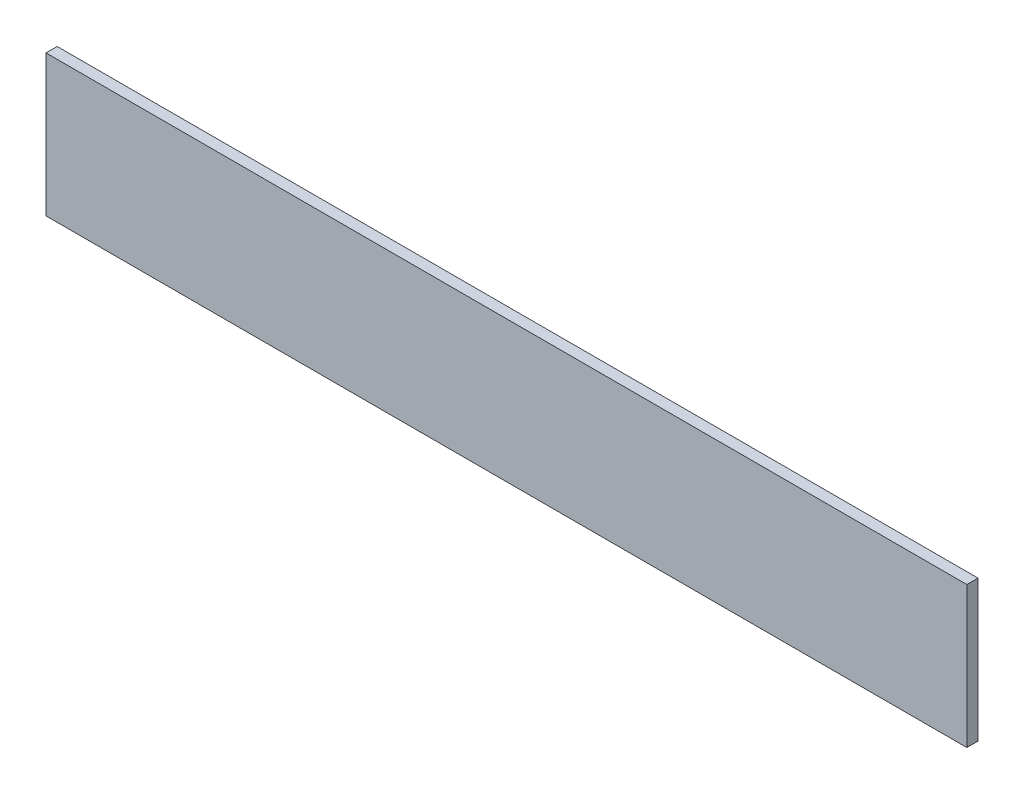
ISO-10303-21;
HEADER;
FILE_DESCRIPTION(('STEP AP214'),'2;1');
FILE_NAME('part.step','',(''),(''),'','','');
FILE_SCHEMA(('AUTOMOTIVE_DESIGN { 1 0 10303 214 1 1 1 1 }'));
ENDSEC;
DATA;
#1=APPLICATION_CONTEXT('core data for automotive mechanical design processes');
#2=APPLICATION_PROTOCOL_DEFINITION('international standard','automotive_design',2000,#1);
#3=PRODUCT_CONTEXT('',#1,'mechanical');
#4=PRODUCT('Part','Part','',(#3));
#5=PRODUCT_RELATED_PRODUCT_CATEGORY('part','',(#4));
#6=PRODUCT_DEFINITION_FORMATION('','',#4);
#7=PRODUCT_DEFINITION_CONTEXT('part definition',#1,'design');
#8=PRODUCT_DEFINITION('design','',#6,#7);
#9=PRODUCT_DEFINITION_SHAPE('','',#8);
#10=(LENGTH_UNIT() NAMED_UNIT(*) SI_UNIT(.MILLI.,.METRE.));
#11=(NAMED_UNIT(*) PLANE_ANGLE_UNIT() SI_UNIT($,.RADIAN.));
#12=(NAMED_UNIT(*) SI_UNIT($,.STERADIAN.) SOLID_ANGLE_UNIT());
#13=UNCERTAINTY_MEASURE_WITH_UNIT(LENGTH_MEASURE(1.E-05),#10,'distance_accuracy_value','');
#14=(GEOMETRIC_REPRESENTATION_CONTEXT(3) GLOBAL_UNCERTAINTY_ASSIGNED_CONTEXT((#13)) GLOBAL_UNIT_ASSIGNED_CONTEXT((#10,
#11,#12)) REPRESENTATION_CONTEXT('',''));
#15=CARTESIAN_POINT('',(0.,0.,0.));
#16=DIRECTION('',(0.,0.,1.));
#17=DIRECTION('',(1.,0.,0.));
#18=AXIS2_PLACEMENT_3D('',#15,#16,#17);
#19=CARTESIAN_POINT('',(-391.026345083488,114.478107606679,11.2));
#20=DIRECTION('',(1.,0.,0.));
#21=DIRECTION('',(0.,1.,0.));
#22=AXIS2_PLACEMENT_3D('',#19,#20,#21);
#23=PLANE('',#22);
#24=DIRECTION('',(0.,-1.,0.));
#25=VECTOR('',#24,1.);
#26=CARTESIAN_POINT('',(-391.026345083488,114.478107606679,0.));
#27=LINE('',#26,#25);
#28=CARTESIAN_POINT('',(-391.026345083488,114.478107606679,0.));
#29=VERTEX_POINT('',#28);
#30=CARTESIAN_POINT('',(-391.026345083488,-27.2538923933209,0.));
#31=VERTEX_POINT('',#30);
#32=EDGE_CURVE('E111',#29,#31,#27,.T.);
#33=ORIENTED_EDGE('',*,*,#32,.T.);
#34=DIRECTION('',(0.,0.,-1.));
#35=VECTOR('',#34,1.);
#36=CARTESIAN_POINT('',(-391.026345083488,-27.2538923933209,11.2));
#37=LINE('',#36,#35);
#38=CARTESIAN_POINT('',(-391.026345083488,-27.2538923933209,11.2));
#39=VERTEX_POINT('',#38);
#40=EDGE_CURVE('E11',#39,#31,#37,.T.);
#41=ORIENTED_EDGE('',*,*,#40,.F.);
#42=DIRECTION('',(0.,-1.,0.));
#43=VECTOR('',#42,1.);
#44=CARTESIAN_POINT('',(-391.026345083488,114.478107606679,11.2));
#45=LINE('',#44,#43);
#46=CARTESIAN_POINT('',(-391.026345083488,114.478107606679,11.2));
#47=VERTEX_POINT('',#46);
#48=EDGE_CURVE('E95',#47,#39,#45,.T.);
#49=ORIENTED_EDGE('',*,*,#48,.F.);
#50=DIRECTION('',(0.,0.,-1.));
#51=VECTOR('',#50,1.);
#52=CARTESIAN_POINT('',(-391.026345083488,114.478107606679,11.2));
#53=LINE('',#52,#51);
#54=EDGE_CURVE('E107',#47,#29,#53,.T.);
#55=ORIENTED_EDGE('',*,*,#54,.T.);
#56=EDGE_LOOP('',(#33,#41,#49,#55));
#57=FACE_BOUND('',#56,.T.);
#58=ADVANCED_FACE('F43',(#57),#23,.F.);
#59=CARTESIAN_POINT('',(-391.026345083488,-27.2538923933209,11.2));
#60=DIRECTION('',(0.,1.,0.));
#61=DIRECTION('',(0.,0.,1.));
#62=AXIS2_PLACEMENT_3D('',#59,#60,#61);
#63=PLANE('',#62);
#64=DIRECTION('',(1.,0.,0.));
#65=VECTOR('',#64,1.);
#66=CARTESIAN_POINT('',(-391.026345083488,-27.2538923933209,0.));
#67=LINE('',#66,#65);
#68=CARTESIAN_POINT('',(533.373654916512,-27.2538923933209,0.));
#69=VERTEX_POINT('',#68);
#70=EDGE_CURVE('E100',#31,#69,#67,.T.);
#71=ORIENTED_EDGE('',*,*,#70,.T.);
#72=DIRECTION('',(0.,0.,-1.));
#73=VECTOR('',#72,1.);
#74=CARTESIAN_POINT('',(533.373654916512,-27.2538923933209,11.2));
#75=LINE('',#74,#73);
#76=CARTESIAN_POINT('',(533.373654916512,-27.2538923933209,11.2));
#77=VERTEX_POINT('',#76);
#78=EDGE_CURVE('E52',#77,#69,#75,.T.);
#79=ORIENTED_EDGE('',*,*,#78,.F.);
#80=DIRECTION('',(1.,0.,0.));
#81=VECTOR('',#80,1.);
#82=CARTESIAN_POINT('',(-391.026345083488,-27.2538923933209,11.2));
#83=LINE('',#82,#81);
#84=EDGE_CURVE('E90',#39,#77,#83,.T.);
#85=ORIENTED_EDGE('',*,*,#84,.F.);
#86=ORIENTED_EDGE('',*,*,#40,.T.);
#87=EDGE_LOOP('',(#71,#79,#85,#86));
#88=FACE_BOUND('',#87,.T.);
#89=ADVANCED_FACE('F99',(#88),#63,.F.);
#90=CARTESIAN_POINT('',(533.373654916512,114.478107606679,11.2));
#91=DIRECTION('',(-1.,0.,0.));
#92=DIRECTION('',(0.,-1.,0.));
#93=AXIS2_PLACEMENT_3D('',#90,#91,#92);
#94=PLANE('',#93);
#95=DIRECTION('',(0.,1.,0.));
#96=VECTOR('',#95,1.);
#97=CARTESIAN_POINT('',(533.373654916512,114.478107606679,0.));
#98=LINE('',#97,#96);
#99=CARTESIAN_POINT('',(533.373654916512,114.478107606679,0.));
#100=VERTEX_POINT('',#99);
#101=EDGE_CURVE('E77',#69,#100,#98,.T.);
#102=ORIENTED_EDGE('',*,*,#101,.T.);
#103=DIRECTION('',(0.,0.,-1.));
#104=VECTOR('',#103,1.);
#105=CARTESIAN_POINT('',(533.373654916512,114.478107606679,11.2));
#106=LINE('',#105,#104);
#107=CARTESIAN_POINT('',(533.373654916512,114.478107606679,11.2));
#108=VERTEX_POINT('',#107);
#109=EDGE_CURVE('E102',#108,#100,#106,.T.);
#110=ORIENTED_EDGE('',*,*,#109,.F.);
#111=DIRECTION('',(0.,1.,0.));
#112=VECTOR('',#111,1.);
#113=CARTESIAN_POINT('',(533.373654916512,114.478107606679,11.2));
#114=LINE('',#113,#112);
#115=EDGE_CURVE('E93',#77,#108,#114,.T.);
#116=ORIENTED_EDGE('',*,*,#115,.F.);
#117=ORIENTED_EDGE('',*,*,#78,.T.);
#118=EDGE_LOOP('',(#102,#110,#116,#117));
#119=FACE_BOUND('',#118,.T.);
#120=ADVANCED_FACE('F103',(#119),#94,.F.);
#121=CARTESIAN_POINT('',(-391.026345083488,114.478107606679,11.2));
#122=DIRECTION('',(0.,-1.,0.));
#123=DIRECTION('',(0.,0.,-1.));
#124=AXIS2_PLACEMENT_3D('',#121,#122,#123);
#125=PLANE('',#124);
#126=DIRECTION('',(-1.,0.,0.));
#127=VECTOR('',#126,1.);
#128=CARTESIAN_POINT('',(-391.026345083488,114.478107606679,0.));
#129=LINE('',#128,#127);
#130=EDGE_CURVE('E83',#100,#29,#129,.T.);
#131=ORIENTED_EDGE('',*,*,#130,.T.);
#132=ORIENTED_EDGE('',*,*,#54,.F.);
#133=DIRECTION('',(-1.,0.,0.));
#134=VECTOR('',#133,1.);
#135=CARTESIAN_POINT('',(-391.026345083488,114.478107606679,11.2));
#136=LINE('',#135,#134);
#137=EDGE_CURVE('E60',#108,#47,#136,.T.);
#138=ORIENTED_EDGE('',*,*,#137,.F.);
#139=ORIENTED_EDGE('',*,*,#109,.T.);
#140=EDGE_LOOP('',(#131,#132,#138,#139));
#141=FACE_BOUND('',#140,.T.);
#142=ADVANCED_FACE('F124',(#141),#125,.F.);
#143=CARTESIAN_POINT('',(0.,0.,11.2));
#144=DIRECTION('',(0.,0.,1.));
#145=DIRECTION('',(1.,0.,0.));
#146=AXIS2_PLACEMENT_3D('',#143,#144,#145);
#147=PLANE('',#146);
#148=ORIENTED_EDGE('',*,*,#48,.T.);
#149=ORIENTED_EDGE('',*,*,#84,.T.);
#150=ORIENTED_EDGE('',*,*,#115,.T.);
#151=ORIENTED_EDGE('',*,*,#137,.T.);
#152=EDGE_LOOP('',(#148,#149,#150,#151));
#153=FACE_BOUND('',#152,.T.);
#154=ADVANCED_FACE('F91',(#153),#147,.T.);
#155=CARTESIAN_POINT('',(0.,0.,0.));
#156=DIRECTION('',(0.,0.,1.));
#157=DIRECTION('',(1.,0.,0.));
#158=AXIS2_PLACEMENT_3D('',#155,#156,#157);
#159=PLANE('',#158);
#160=ORIENTED_EDGE('',*,*,#32,.F.);
#161=ORIENTED_EDGE('',*,*,#130,.F.);
#162=ORIENTED_EDGE('',*,*,#101,.F.);
#163=ORIENTED_EDGE('',*,*,#70,.F.);
#164=EDGE_LOOP('',(#160,#161,#162,#163));
#165=FACE_BOUND('',#164,.T.);
#166=ADVANCED_FACE('F127',(#165),#159,.F.);
#167=CLOSED_SHELL('',(#58,#89,#120,#142,#154,#166));
#168=MANIFOLD_SOLID_BREP('B2',#167);
#169=ADVANCED_BREP_SHAPE_REPRESENTATION('',(#18,#168),#14);
#170=SHAPE_DEFINITION_REPRESENTATION(#9,#169);
ENDSEC;
END-ISO-10303-21;
